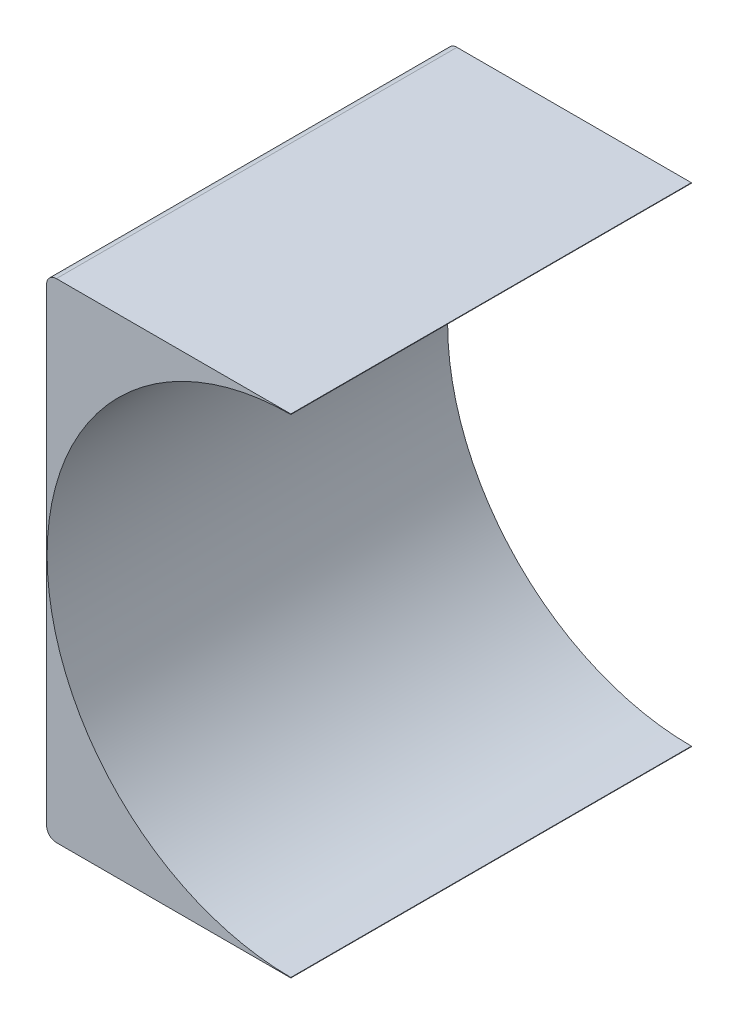
ISO-10303-21;
HEADER;
FILE_DESCRIPTION(('STEP AP214'),'2;1');
FILE_NAME('part.step','',(''),(''),'','','');
FILE_SCHEMA(('AUTOMOTIVE_DESIGN { 1 0 10303 214 1 1 1 1 }'));
ENDSEC;
DATA;
#1=APPLICATION_CONTEXT('core data for automotive mechanical design processes');
#2=APPLICATION_PROTOCOL_DEFINITION('international standard','automotive_design',2000,#1);
#3=PRODUCT_CONTEXT('',#1,'mechanical');
#4=PRODUCT('Part','Part','',(#3));
#5=PRODUCT_RELATED_PRODUCT_CATEGORY('part','',(#4));
#6=PRODUCT_DEFINITION_FORMATION('','',#4);
#7=PRODUCT_DEFINITION_CONTEXT('part definition',#1,'design');
#8=PRODUCT_DEFINITION('design','',#6,#7);
#9=PRODUCT_DEFINITION_SHAPE('','',#8);
#10=(LENGTH_UNIT() NAMED_UNIT(*) SI_UNIT(.MILLI.,.METRE.));
#11=(NAMED_UNIT(*) PLANE_ANGLE_UNIT() SI_UNIT($,.RADIAN.));
#12=(NAMED_UNIT(*) SI_UNIT($,.STERADIAN.) SOLID_ANGLE_UNIT());
#13=UNCERTAINTY_MEASURE_WITH_UNIT(LENGTH_MEASURE(1.E-05),#10,'distance_accuracy_value','');
#14=(GEOMETRIC_REPRESENTATION_CONTEXT(3) GLOBAL_UNCERTAINTY_ASSIGNED_CONTEXT((#13)) GLOBAL_UNIT_ASSIGNED_CONTEXT((#10,
#11,#12)) REPRESENTATION_CONTEXT('',''));
#15=CARTESIAN_POINT('',(0.,0.,0.));
#16=DIRECTION('',(0.,0.,1.));
#17=DIRECTION('',(1.,0.,0.));
#18=AXIS2_PLACEMENT_3D('',#15,#16,#17);
#19=CARTESIAN_POINT('',(12.5,50.,20.5));
#20=DIRECTION('',(-1.,0.,0.));
#21=DIRECTION('',(0.,0.,1.));
#22=AXIS2_PLACEMENT_3D('',#19,#20,#21);
#23=PLANE('',#22);
#24=DIRECTION('',(0.,-1.,0.));
#25=VECTOR('',#24,1.);
#26=CARTESIAN_POINT('',(12.5,50.,-20.5));
#27=LINE('',#26,#25);
#28=CARTESIAN_POINT('',(12.5,0.0500000000000014,-20.5));
#29=VERTEX_POINT('',#28);
#30=CARTESIAN_POINT('',(12.5,0.,-20.5));
#31=VERTEX_POINT('',#30);
#32=EDGE_CURVE('E131',#29,#31,#27,.T.);
#33=ORIENTED_EDGE('',*,*,#32,.F.);
#34=DIRECTION('',(0.,0.,1.));
#35=VECTOR('',#34,1.);
#36=CARTESIAN_POINT('',(12.5,0.0500000000000014,-20.5));
#37=LINE('',#36,#35);
#38=CARTESIAN_POINT('',(12.5,0.0500000000000014,20.5));
#39=VERTEX_POINT('',#38);
#40=EDGE_CURVE('E108',#29,#39,#37,.T.);
#41=ORIENTED_EDGE('',*,*,#40,.T.);
#42=DIRECTION('',(0.,-1.,0.));
#43=VECTOR('',#42,1.);
#44=CARTESIAN_POINT('',(12.5,50.,20.5));
#45=LINE('',#44,#43);
#46=CARTESIAN_POINT('',(12.5,0.,20.5));
#47=VERTEX_POINT('',#46);
#48=EDGE_CURVE('E130',#39,#47,#45,.T.);
#49=ORIENTED_EDGE('',*,*,#48,.T.);
#50=DIRECTION('',(0.,0.,-1.));
#51=VECTOR('',#50,1.);
#52=CARTESIAN_POINT('',(12.5,0.,20.5));
#53=LINE('',#52,#51);
#54=EDGE_CURVE('E179',#47,#31,#53,.T.);
#55=ORIENTED_EDGE('',*,*,#54,.T.);
#56=EDGE_LOOP('',(#33,#41,#49,#55));
#57=FACE_BOUND('',#56,.T.);
#58=ADVANCED_FACE('F39',(#57),#23,.F.);
#59=CARTESIAN_POINT('',(-12.5,50.,20.5));
#60=DIRECTION('',(1.,0.,0.));
#61=DIRECTION('',(0.,0.,-1.));
#62=AXIS2_PLACEMENT_3D('',#59,#60,#61);
#63=PLANE('',#62);
#64=DIRECTION('',(0.,-1.,0.));
#65=VECTOR('',#64,1.);
#66=CARTESIAN_POINT('',(-12.5,50.,20.5));
#67=LINE('',#66,#65);
#68=CARTESIAN_POINT('',(-12.5,49.,20.5));
#69=VERTEX_POINT('',#68);
#70=CARTESIAN_POINT('',(-12.5,1.,20.5));
#71=VERTEX_POINT('',#70);
#72=EDGE_CURVE('E141',#69,#71,#67,.T.);
#73=ORIENTED_EDGE('',*,*,#72,.F.);
#74=DIRECTION('',(0.,0.,1.));
#75=VECTOR('',#74,1.);
#76=CARTESIAN_POINT('',(-12.5,49.,-20.5));
#77=LINE('',#76,#75);
#78=CARTESIAN_POINT('',(-12.5,49.,-20.5));
#79=VERTEX_POINT('',#78);
#80=EDGE_CURVE('E48',#69,#79,#77,.F.);
#81=ORIENTED_EDGE('',*,*,#80,.T.);
#82=DIRECTION('',(0.,-1.,0.));
#83=VECTOR('',#82,1.);
#84=CARTESIAN_POINT('',(-12.5,50.,-20.5));
#85=LINE('',#84,#83);
#86=CARTESIAN_POINT('',(-12.5,1.,-20.5));
#87=VERTEX_POINT('',#86);
#88=EDGE_CURVE('E136',#79,#87,#85,.T.);
#89=ORIENTED_EDGE('',*,*,#88,.T.);
#90=DIRECTION('',(0.,0.,1.));
#91=VECTOR('',#90,1.);
#92=CARTESIAN_POINT('',(-12.5,1.,20.5));
#93=LINE('',#92,#91);
#94=EDGE_CURVE('E144',#87,#71,#93,.T.);
#95=ORIENTED_EDGE('',*,*,#94,.T.);
#96=EDGE_LOOP('',(#73,#81,#89,#95));
#97=FACE_BOUND('',#96,.T.);
#98=ADVANCED_FACE('F203',(#97),#63,.F.);
#99=CARTESIAN_POINT('',(12.5,50.,20.5));
#100=DIRECTION('',(0.,0.,-1.));
#101=DIRECTION('',(-1.,0.,0.));
#102=AXIS2_PLACEMENT_3D('',#99,#100,#101);
#103=PLANE('',#102);
#104=DIRECTION('',(1.,0.,0.));
#105=VECTOR('',#104,1.);
#106=CARTESIAN_POINT('',(12.5,50.,20.5));
#107=LINE('',#106,#105);
#108=CARTESIAN_POINT('',(-11.5,50.,20.5));
#109=VERTEX_POINT('',#108);
#110=CARTESIAN_POINT('',(12.5,50.,20.5));
#111=VERTEX_POINT('',#110);
#112=EDGE_CURVE('E167',#109,#111,#107,.T.);
#113=ORIENTED_EDGE('',*,*,#112,.F.);
#114=CARTESIAN_POINT('',(-11.5,49.,20.5));
#115=DIRECTION('',(0.,0.,-1.));
#116=DIRECTION('',(-1.,0.,0.));
#117=AXIS2_PLACEMENT_3D('',#114,#115,#116);
#118=CIRCLE('',#117,1.);
#119=EDGE_CURVE('E62',#109,#69,#118,.F.);
#120=ORIENTED_EDGE('',*,*,#119,.T.);
#121=ORIENTED_EDGE('',*,*,#72,.T.);
#122=CARTESIAN_POINT('',(-11.5,1.,20.5));
#123=DIRECTION('',(0.,0.,-1.));
#124=DIRECTION('',(-1.,0.,0.));
#125=AXIS2_PLACEMENT_3D('',#122,#123,#124);
#126=CIRCLE('',#125,1.);
#127=CARTESIAN_POINT('',(-11.5,0.,20.5));
#128=VERTEX_POINT('',#127);
#129=EDGE_CURVE('E148',#71,#128,#126,.F.);
#130=ORIENTED_EDGE('',*,*,#129,.T.);
#131=DIRECTION('',(1.,0.,0.));
#132=VECTOR('',#131,1.);
#133=CARTESIAN_POINT('',(12.5,0.,20.5));
#134=LINE('',#133,#132);
#135=EDGE_CURVE('E184',#128,#47,#134,.T.);
#136=ORIENTED_EDGE('',*,*,#135,.T.);
#137=ORIENTED_EDGE('',*,*,#48,.F.);
#138=CARTESIAN_POINT('',(12.5,25.,20.5));
#139=DIRECTION('',(0.,0.,1.));
#140=DIRECTION('',(1.,0.,0.));
#141=AXIS2_PLACEMENT_3D('',#138,#139,#140);
#142=CIRCLE('',#141,24.95);
#143=CARTESIAN_POINT('',(12.5,49.95,20.5));
#144=VERTEX_POINT('',#143);
#145=EDGE_CURVE('E113',#144,#39,#142,.T.);
#146=ORIENTED_EDGE('',*,*,#145,.F.);
#147=EDGE_CURVE('E123',#111,#144,#45,.T.);
#148=ORIENTED_EDGE('',*,*,#147,.F.);
#149=EDGE_LOOP('',(#113,#120,#121,#130,#136,#137,#146,#148));
#150=FACE_BOUND('',#149,.T.);
#151=ADVANCED_FACE('F170',(#150),#103,.F.);
#152=ORIENTED_EDGE('',*,*,#147,.T.);
#153=DIRECTION('',(0.,0.,1.));
#154=VECTOR('',#153,1.);
#155=CARTESIAN_POINT('',(12.5,49.95,-20.5));
#156=LINE('',#155,#154);
#157=CARTESIAN_POINT('',(12.5,49.95,-20.5));
#158=VERTEX_POINT('',#157);
#159=EDGE_CURVE('E105',#144,#158,#156,.F.);
#160=ORIENTED_EDGE('',*,*,#159,.T.);
#161=CARTESIAN_POINT('',(12.5,50.,-20.5));
#162=VERTEX_POINT('',#161);
#163=EDGE_CURVE('E120',#162,#158,#27,.T.);
#164=ORIENTED_EDGE('',*,*,#163,.F.);
#165=DIRECTION('',(0.,0.,-1.));
#166=VECTOR('',#165,1.);
#167=CARTESIAN_POINT('',(12.5,50.,20.5));
#168=LINE('',#167,#166);
#169=EDGE_CURVE('E172',#111,#162,#168,.T.);
#170=ORIENTED_EDGE('',*,*,#169,.F.);
#171=EDGE_LOOP('',(#152,#160,#164,#170));
#172=FACE_BOUND('',#171,.T.);
#173=ADVANCED_FACE('F118',(#172),#23,.F.);
#174=CARTESIAN_POINT('',(12.5,50.,-20.5));
#175=DIRECTION('',(0.,0.,1.));
#176=DIRECTION('',(1.,0.,0.));
#177=AXIS2_PLACEMENT_3D('',#174,#175,#176);
#178=PLANE('',#177);
#179=ORIENTED_EDGE('',*,*,#88,.F.);
#180=CARTESIAN_POINT('',(-11.5,49.,-20.5));
#181=DIRECTION('',(0.,0.,1.));
#182=DIRECTION('',(1.,0.,0.));
#183=AXIS2_PLACEMENT_3D('',#180,#181,#182);
#184=CIRCLE('',#183,1.);
#185=CARTESIAN_POINT('',(-11.5,50.,-20.5));
#186=VERTEX_POINT('',#185);
#187=EDGE_CURVE('E11',#79,#186,#184,.F.);
#188=ORIENTED_EDGE('',*,*,#187,.T.);
#189=DIRECTION('',(-1.,0.,0.));
#190=VECTOR('',#189,1.);
#191=CARTESIAN_POINT('',(12.5,50.,-20.5));
#192=LINE('',#191,#190);
#193=EDGE_CURVE('E128',#162,#186,#192,.T.);
#194=ORIENTED_EDGE('',*,*,#193,.F.);
#195=ORIENTED_EDGE('',*,*,#163,.T.);
#196=CARTESIAN_POINT('',(12.5,25.,-20.5));
#197=DIRECTION('',(0.,0.,1.));
#198=DIRECTION('',(1.,0.,0.));
#199=AXIS2_PLACEMENT_3D('',#196,#197,#198);
#200=CIRCLE('',#199,24.95);
#201=EDGE_CURVE('E102',#158,#29,#200,.T.);
#202=ORIENTED_EDGE('',*,*,#201,.T.);
#203=ORIENTED_EDGE('',*,*,#32,.T.);
#204=DIRECTION('',(-1.,0.,0.));
#205=VECTOR('',#204,1.);
#206=CARTESIAN_POINT('',(12.5,0.,-20.5));
#207=LINE('',#206,#205);
#208=CARTESIAN_POINT('',(-11.5,0.,-20.5));
#209=VERTEX_POINT('',#208);
#210=EDGE_CURVE('E173',#31,#209,#207,.T.);
#211=ORIENTED_EDGE('',*,*,#210,.T.);
#212=CARTESIAN_POINT('',(-11.5,1.,-20.5));
#213=DIRECTION('',(0.,0.,1.));
#214=DIRECTION('',(1.,0.,0.));
#215=AXIS2_PLACEMENT_3D('',#212,#213,#214);
#216=CIRCLE('',#215,1.);
#217=EDGE_CURVE('E154',#209,#87,#216,.F.);
#218=ORIENTED_EDGE('',*,*,#217,.T.);
#219=EDGE_LOOP('',(#179,#188,#194,#195,#202,#203,#211,#218));
#220=FACE_BOUND('',#219,.T.);
#221=ADVANCED_FACE('F126',(#220),#178,.F.);
#222=CARTESIAN_POINT('',(0.,50.,0.));
#223=DIRECTION('',(0.,1.,0.));
#224=DIRECTION('',(0.,0.,1.));
#225=AXIS2_PLACEMENT_3D('',#222,#223,#224);
#226=PLANE('',#225);
#227=ORIENTED_EDGE('',*,*,#193,.T.);
#228=DIRECTION('',(0.,0.,1.));
#229=VECTOR('',#228,1.);
#230=CARTESIAN_POINT('',(-11.5,50.,20.5));
#231=LINE('',#230,#229);
#232=EDGE_CURVE('E158',#186,#109,#231,.T.);
#233=ORIENTED_EDGE('',*,*,#232,.T.);
#234=ORIENTED_EDGE('',*,*,#112,.T.);
#235=ORIENTED_EDGE('',*,*,#169,.T.);
#236=EDGE_LOOP('',(#227,#233,#234,#235));
#237=FACE_BOUND('',#236,.T.);
#238=ADVANCED_FACE('F166',(#237),#226,.T.);
#239=CARTESIAN_POINT('',(0.,0.,0.));
#240=DIRECTION('',(0.,1.,0.));
#241=DIRECTION('',(0.,0.,1.));
#242=AXIS2_PLACEMENT_3D('',#239,#240,#241);
#243=PLANE('',#242);
#244=ORIENTED_EDGE('',*,*,#135,.F.);
#245=DIRECTION('',(0.,0.,1.));
#246=VECTOR('',#245,1.);
#247=CARTESIAN_POINT('',(-11.5,0.,0.));
#248=LINE('',#247,#246);
#249=EDGE_CURVE('E151',#128,#209,#248,.F.);
#250=ORIENTED_EDGE('',*,*,#249,.T.);
#251=ORIENTED_EDGE('',*,*,#210,.F.);
#252=ORIENTED_EDGE('',*,*,#54,.F.);
#253=EDGE_LOOP('',(#244,#250,#251,#252));
#254=FACE_BOUND('',#253,.T.);
#255=ADVANCED_FACE('F196',(#254),#243,.F.);
#256=CARTESIAN_POINT('',(-11.5,1.,20.5));
#257=DIRECTION('',(0.,0.,1.));
#258=DIRECTION('',(1.,0.,0.));
#259=AXIS2_PLACEMENT_3D('',#256,#257,#258);
#260=CYLINDRICAL_SURFACE('',#259,1.);
#261=ORIENTED_EDGE('',*,*,#217,.F.);
#262=ORIENTED_EDGE('',*,*,#249,.F.);
#263=ORIENTED_EDGE('',*,*,#129,.F.);
#264=ORIENTED_EDGE('',*,*,#94,.F.);
#265=EDGE_LOOP('',(#261,#262,#263,#264));
#266=FACE_BOUND('',#265,.T.);
#267=ADVANCED_FACE('F201',(#266),#260,.T.);
#268=CARTESIAN_POINT('',(12.5,25.,-20.5));
#269=DIRECTION('',(0.,0.,1.));
#270=DIRECTION('',(1.,0.,0.));
#271=AXIS2_PLACEMENT_3D('',#268,#269,#270);
#272=CYLINDRICAL_SURFACE('',#271,24.95);
#273=ORIENTED_EDGE('',*,*,#201,.F.);
#274=ORIENTED_EDGE('',*,*,#159,.F.);
#275=ORIENTED_EDGE('',*,*,#145,.T.);
#276=ORIENTED_EDGE('',*,*,#40,.F.);
#277=EDGE_LOOP('',(#273,#274,#275,#276));
#278=FACE_BOUND('',#277,.T.);
#279=ADVANCED_FACE('F104',(#278),#272,.F.);
#280=CARTESIAN_POINT('',(-11.5,49.,0.));
#281=DIRECTION('',(0.,0.,-1.));
#282=DIRECTION('',(-1.,0.,0.));
#283=AXIS2_PLACEMENT_3D('',#280,#281,#282);
#284=CYLINDRICAL_SURFACE('',#283,1.);
#285=ORIENTED_EDGE('',*,*,#187,.F.);
#286=ORIENTED_EDGE('',*,*,#80,.F.);
#287=ORIENTED_EDGE('',*,*,#119,.F.);
#288=ORIENTED_EDGE('',*,*,#232,.F.);
#289=EDGE_LOOP('',(#285,#286,#287,#288));
#290=FACE_BOUND('',#289,.T.);
#291=ADVANCED_FACE('F41',(#290),#284,.T.);
#292=CLOSED_SHELL('',(#58,#98,#151,#173,#221,#238,#255,#267,#279,#291));
#293=MANIFOLD_SOLID_BREP('B2',#292);
#294=ADVANCED_BREP_SHAPE_REPRESENTATION('',(#18,#293),#14);
#295=SHAPE_DEFINITION_REPRESENTATION(#9,#294);
ENDSEC;
END-ISO-10303-21;
